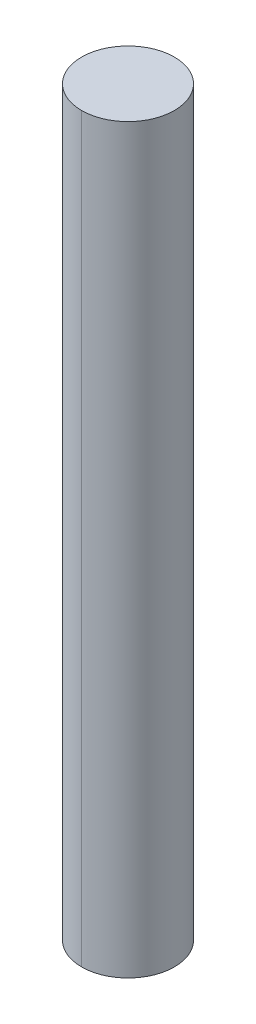
ISO-10303-21;
HEADER;
FILE_DESCRIPTION(('STEP AP214'),'2;1');
FILE_NAME('part.step','',(''),(''),'','','');
FILE_SCHEMA(('AUTOMOTIVE_DESIGN { 1 0 10303 214 1 1 1 1 }'));
ENDSEC;
DATA;
#1=APPLICATION_CONTEXT('core data for automotive mechanical design processes');
#2=APPLICATION_PROTOCOL_DEFINITION('international standard','automotive_design',2000,#1);
#3=PRODUCT_CONTEXT('',#1,'mechanical');
#4=PRODUCT('Part','Part','',(#3));
#5=PRODUCT_RELATED_PRODUCT_CATEGORY('part','',(#4));
#6=PRODUCT_DEFINITION_FORMATION('','',#4);
#7=PRODUCT_DEFINITION_CONTEXT('part definition',#1,'design');
#8=PRODUCT_DEFINITION('design','',#6,#7);
#9=PRODUCT_DEFINITION_SHAPE('','',#8);
#10=(LENGTH_UNIT() NAMED_UNIT(*) SI_UNIT(.MILLI.,.METRE.));
#11=(NAMED_UNIT(*) PLANE_ANGLE_UNIT() SI_UNIT($,.RADIAN.));
#12=(NAMED_UNIT(*) SI_UNIT($,.STERADIAN.) SOLID_ANGLE_UNIT());
#13=UNCERTAINTY_MEASURE_WITH_UNIT(LENGTH_MEASURE(1.E-05),#10,'distance_accuracy_value','');
#14=(GEOMETRIC_REPRESENTATION_CONTEXT(3) GLOBAL_UNCERTAINTY_ASSIGNED_CONTEXT((#13)) GLOBAL_UNIT_ASSIGNED_CONTEXT((#10,
#11,#12)) REPRESENTATION_CONTEXT('',''));
#15=CARTESIAN_POINT('',(0.,0.,0.));
#16=DIRECTION('',(0.,0.,1.));
#17=DIRECTION('',(1.,0.,0.));
#18=AXIS2_PLACEMENT_3D('',#15,#16,#17);
#19=CARTESIAN_POINT('',(0.,-11.,0.));
#20=DIRECTION('',(0.,1.,0.));
#21=DIRECTION('',(-1.,0.,0.));
#22=AXIS2_PLACEMENT_3D('',#19,#20,#21);
#23=CYLINDRICAL_SURFACE('',#22,1.);
#24=CARTESIAN_POINT('',(0.,-11.,0.));
#25=DIRECTION('',(0.,-1.,0.));
#26=DIRECTION('',(0.,0.,-1.));
#27=AXIS2_PLACEMENT_3D('',#24,#25,#26);
#28=CIRCLE('',#27,1.);
#29=CARTESIAN_POINT('',(0.,-11.,-1.));
#30=VERTEX_POINT('',#29);
#31=CARTESIAN_POINT('',(0.,-11.,1.));
#32=VERTEX_POINT('',#31);
#33=EDGE_CURVE('E10',#30,#32,#28,.T.);
#34=ORIENTED_EDGE('',*,*,#33,.F.);
#35=DIRECTION('',(0.,1.,0.));
#36=VECTOR('',#35,1.);
#37=CARTESIAN_POINT('',(0.,-11.,-1.));
#38=LINE('',#37,#36);
#39=CARTESIAN_POINT('',(0.,5.,-1.));
#40=VERTEX_POINT('',#39);
#41=EDGE_CURVE('E25',#30,#40,#38,.T.);
#42=ORIENTED_EDGE('',*,*,#41,.T.);
#43=CARTESIAN_POINT('',(0.,5.,0.));
#44=DIRECTION('',(0.,-1.,0.));
#45=DIRECTION('',(0.,0.,-1.));
#46=AXIS2_PLACEMENT_3D('',#43,#44,#45);
#47=CIRCLE('',#46,1.);
#48=CARTESIAN_POINT('',(0.,5.,1.));
#49=VERTEX_POINT('',#48);
#50=EDGE_CURVE('E42',#40,#49,#47,.T.);
#51=ORIENTED_EDGE('',*,*,#50,.T.);
#52=DIRECTION('',(0.,1.,0.));
#53=VECTOR('',#52,1.);
#54=CARTESIAN_POINT('',(0.,-11.,1.));
#55=LINE('',#54,#53);
#56=EDGE_CURVE('E39',#32,#49,#55,.T.);
#57=ORIENTED_EDGE('',*,*,#56,.F.);
#58=EDGE_LOOP('',(#34,#42,#51,#57));
#59=FACE_BOUND('',#58,.T.);
#60=ADVANCED_FACE('F16',(#59),#23,.T.);
#61=CARTESIAN_POINT('',(0.,-11.,0.));
#62=DIRECTION('',(0.,1.,0.));
#63=DIRECTION('',(1.,0.,0.));
#64=AXIS2_PLACEMENT_3D('',#61,#62,#63);
#65=CYLINDRICAL_SURFACE('',#64,1.);
#66=CARTESIAN_POINT('',(0.,5.,0.));
#67=DIRECTION('',(0.,-1.,0.));
#68=DIRECTION('',(0.,0.,-1.));
#69=AXIS2_PLACEMENT_3D('',#66,#67,#68);
#70=CIRCLE('',#69,1.);
#71=EDGE_CURVE('E46',#49,#40,#70,.T.);
#72=ORIENTED_EDGE('',*,*,#71,.T.);
#73=ORIENTED_EDGE('',*,*,#41,.F.);
#74=CARTESIAN_POINT('',(0.,-11.,0.));
#75=DIRECTION('',(0.,-1.,0.));
#76=DIRECTION('',(0.,0.,-1.));
#77=AXIS2_PLACEMENT_3D('',#74,#75,#76);
#78=CIRCLE('',#77,1.);
#79=EDGE_CURVE('E49',#32,#30,#78,.T.);
#80=ORIENTED_EDGE('',*,*,#79,.F.);
#81=ORIENTED_EDGE('',*,*,#56,.T.);
#82=EDGE_LOOP('',(#72,#73,#80,#81));
#83=FACE_BOUND('',#82,.T.);
#84=ADVANCED_FACE('F50',(#83),#65,.T.);
#85=CARTESIAN_POINT('',(1.,-11.,0.));
#86=DIRECTION('',(0.,1.,0.));
#87=DIRECTION('',(0.,0.,1.));
#88=AXIS2_PLACEMENT_3D('',#85,#86,#87);
#89=PLANE('',#88);
#90=ORIENTED_EDGE('',*,*,#33,.T.);
#91=ORIENTED_EDGE('',*,*,#79,.T.);
#92=EDGE_LOOP('',(#90,#91));
#93=FACE_BOUND('',#92,.T.);
#94=ADVANCED_FACE('F54',(#93),#89,.F.);
#95=CARTESIAN_POINT('',(0.,5.,0.));
#96=DIRECTION('',(0.,-1.,0.));
#97=DIRECTION('',(0.,0.,-1.));
#98=AXIS2_PLACEMENT_3D('',#95,#96,#97);
#99=PLANE('',#98);
#100=ORIENTED_EDGE('',*,*,#50,.F.);
#101=ORIENTED_EDGE('',*,*,#71,.F.);
#102=EDGE_LOOP('',(#100,#101));
#103=FACE_BOUND('',#102,.T.);
#104=ADVANCED_FACE('F56',(#103),#99,.F.);
#105=CLOSED_SHELL('',(#60,#84,#94,#104));
#106=MANIFOLD_SOLID_BREP('B1',#105);
#107=ADVANCED_BREP_SHAPE_REPRESENTATION('',(#18,#106),#14);
#108=SHAPE_DEFINITION_REPRESENTATION(#9,#107);
ENDSEC;
END-ISO-10303-21;
